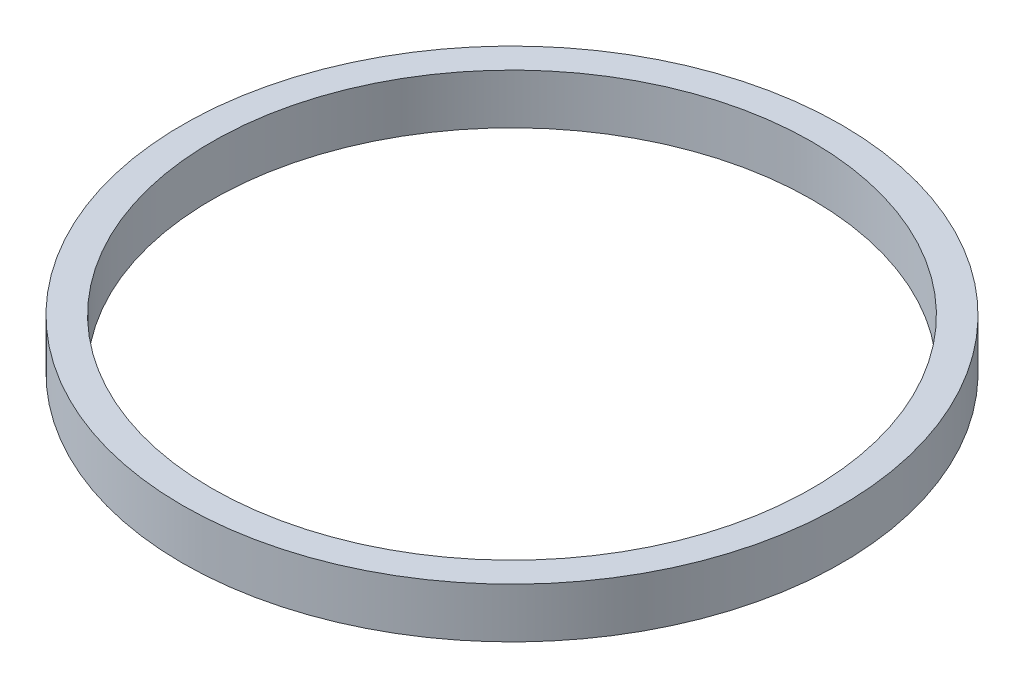
ISO-10303-21;
HEADER;
FILE_DESCRIPTION(('STEP AP214'),'2;1');
FILE_NAME('part.step','',(''),(''),'','','');
FILE_SCHEMA(('AUTOMOTIVE_DESIGN { 1 0 10303 214 1 1 1 1 }'));
ENDSEC;
DATA;
#1=APPLICATION_CONTEXT('core data for automotive mechanical design processes');
#2=APPLICATION_PROTOCOL_DEFINITION('international standard','automotive_design',2000,#1);
#3=PRODUCT_CONTEXT('',#1,'mechanical');
#4=PRODUCT('Part','Part','',(#3));
#5=PRODUCT_RELATED_PRODUCT_CATEGORY('part','',(#4));
#6=PRODUCT_DEFINITION_FORMATION('','',#4);
#7=PRODUCT_DEFINITION_CONTEXT('part definition',#1,'design');
#8=PRODUCT_DEFINITION('design','',#6,#7);
#9=PRODUCT_DEFINITION_SHAPE('','',#8);
#10=(LENGTH_UNIT() NAMED_UNIT(*) SI_UNIT(.MILLI.,.METRE.));
#11=(NAMED_UNIT(*) PLANE_ANGLE_UNIT() SI_UNIT($,.RADIAN.));
#12=(NAMED_UNIT(*) SI_UNIT($,.STERADIAN.) SOLID_ANGLE_UNIT());
#13=UNCERTAINTY_MEASURE_WITH_UNIT(LENGTH_MEASURE(1.E-05),#10,'distance_accuracy_value','');
#14=(GEOMETRIC_REPRESENTATION_CONTEXT(3) GLOBAL_UNCERTAINTY_ASSIGNED_CONTEXT((#13)) GLOBAL_UNIT_ASSIGNED_CONTEXT((#10,
#11,#12)) REPRESENTATION_CONTEXT('',''));
#15=CARTESIAN_POINT('',(0.,0.,0.));
#16=DIRECTION('',(0.,0.,1.));
#17=DIRECTION('',(1.,0.,0.));
#18=AXIS2_PLACEMENT_3D('',#15,#16,#17);
#19=CARTESIAN_POINT('',(0.,0.8,0.));
#20=DIRECTION('',(0.,1.,0.));
#21=DIRECTION('',(0.,0.,1.));
#22=AXIS2_PLACEMENT_3D('',#19,#20,#21);
#23=CYLINDRICAL_SURFACE('',#22,5.1);
#24=CARTESIAN_POINT('',(0.,1.65,0.));
#25=DIRECTION('',(0.,1.,0.));
#26=DIRECTION('',(0.,0.,1.));
#27=AXIS2_PLACEMENT_3D('',#24,#25,#26);
#28=CIRCLE('',#27,5.1);
#29=CARTESIAN_POINT('',(0.,1.65,5.1));
#30=VERTEX_POINT('',#29);
#31=EDGE_CURVE('E17',#30,#30,#28,.T.);
#32=ORIENTED_EDGE('',*,*,#31,.T.);
#33=EDGE_LOOP('',(#32));
#34=FACE_BOUND('',#33,.T.);
#35=CARTESIAN_POINT('',(0.,0.8,0.));
#36=DIRECTION('',(0.,1.,0.));
#37=DIRECTION('',(0.,0.,1.));
#38=AXIS2_PLACEMENT_3D('',#35,#36,#37);
#39=CIRCLE('',#38,5.1);
#40=CARTESIAN_POINT('',(0.,0.8,5.1));
#41=VERTEX_POINT('',#40);
#42=EDGE_CURVE('E26',#41,#41,#39,.T.);
#43=ORIENTED_EDGE('',*,*,#42,.F.);
#44=EDGE_LOOP('',(#43));
#45=FACE_BOUND('',#44,.T.);
#46=ADVANCED_FACE('F14',(#34,#45),#23,.F.);
#47=CARTESIAN_POINT('',(0.,1.65,0.));
#48=DIRECTION('',(0.,-1.,0.));
#49=DIRECTION('',(0.,0.,-1.));
#50=AXIS2_PLACEMENT_3D('',#47,#48,#49);
#51=PLANE('',#50);
#52=CARTESIAN_POINT('',(0.,1.65,0.));
#53=DIRECTION('',(0.,-1.,0.));
#54=DIRECTION('',(0.,0.,-1.));
#55=AXIS2_PLACEMENT_3D('',#52,#53,#54);
#56=CIRCLE('',#55,5.6);
#57=CARTESIAN_POINT('',(0.,1.65,-5.6));
#58=VERTEX_POINT('',#57);
#59=EDGE_CURVE('E21',#58,#58,#56,.T.);
#60=ORIENTED_EDGE('',*,*,#59,.F.);
#61=EDGE_LOOP('',(#60));
#62=FACE_BOUND('',#61,.T.);
#63=ORIENTED_EDGE('',*,*,#31,.F.);
#64=EDGE_LOOP('',(#63));
#65=FACE_BOUND('',#64,.T.);
#66=ADVANCED_FACE('F36',(#62,#65),#51,.F.);
#67=CARTESIAN_POINT('',(0.,0.8,0.));
#68=DIRECTION('',(0.,-1.,0.));
#69=DIRECTION('',(0.,0.,-1.));
#70=AXIS2_PLACEMENT_3D('',#67,#68,#69);
#71=PLANE('',#70);
#72=ORIENTED_EDGE('',*,*,#42,.T.);
#73=EDGE_LOOP('',(#72));
#74=FACE_BOUND('',#73,.T.);
#75=CARTESIAN_POINT('',(0.,0.8,0.));
#76=DIRECTION('',(0.,-1.,0.));
#77=DIRECTION('',(0.,0.,-1.));
#78=AXIS2_PLACEMENT_3D('',#75,#76,#77);
#79=CIRCLE('',#78,5.6);
#80=CARTESIAN_POINT('',(0.,0.8,-5.6));
#81=VERTEX_POINT('',#80);
#82=EDGE_CURVE('E9',#81,#81,#79,.F.);
#83=ORIENTED_EDGE('',*,*,#82,.F.);
#84=EDGE_LOOP('',(#83));
#85=FACE_BOUND('',#84,.T.);
#86=ADVANCED_FACE('F38',(#74,#85),#71,.T.);
#87=CARTESIAN_POINT('',(0.,1.65,0.));
#88=DIRECTION('',(0.,-1.,0.));
#89=DIRECTION('',(0.,0.,-1.));
#90=AXIS2_PLACEMENT_3D('',#87,#88,#89);
#91=CYLINDRICAL_SURFACE('',#90,5.6);
#92=ORIENTED_EDGE('',*,*,#82,.T.);
#93=EDGE_LOOP('',(#92));
#94=FACE_BOUND('',#93,.T.);
#95=ORIENTED_EDGE('',*,*,#59,.T.);
#96=EDGE_LOOP('',(#95));
#97=FACE_BOUND('',#96,.T.);
#98=ADVANCED_FACE('F45',(#94,#97),#91,.T.);
#99=CLOSED_SHELL('',(#46,#66,#86,#98));
#100=MANIFOLD_SOLID_BREP('B1',#99);
#101=ADVANCED_BREP_SHAPE_REPRESENTATION('',(#18,#100),#14);
#102=SHAPE_DEFINITION_REPRESENTATION(#9,#101);
ENDSEC;
END-ISO-10303-21;
